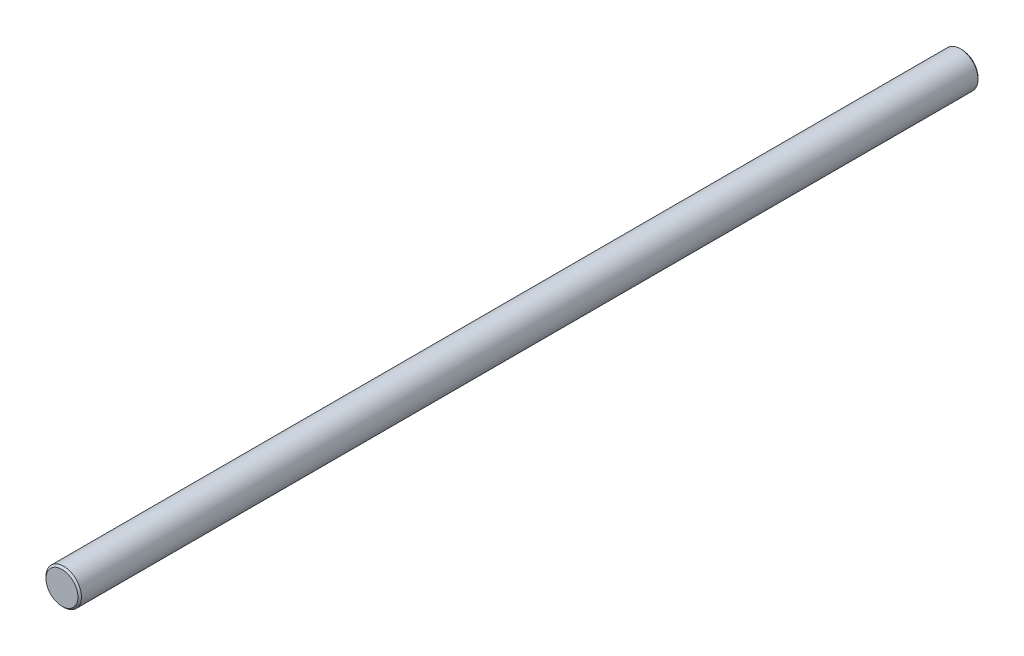
ISO-10303-21;
HEADER;
FILE_DESCRIPTION(('STEP AP214'),'2;1');
FILE_NAME('part.step','',(''),(''),'','','');
FILE_SCHEMA(('AUTOMOTIVE_DESIGN { 1 0 10303 214 1 1 1 1 }'));
ENDSEC;
DATA;
#1=APPLICATION_CONTEXT('core data for automotive mechanical design processes');
#2=APPLICATION_PROTOCOL_DEFINITION('international standard','automotive_design',2000,#1);
#3=PRODUCT_CONTEXT('',#1,'mechanical');
#4=PRODUCT('Part','Part','',(#3));
#5=PRODUCT_RELATED_PRODUCT_CATEGORY('part','',(#4));
#6=PRODUCT_DEFINITION_FORMATION('','',#4);
#7=PRODUCT_DEFINITION_CONTEXT('part definition',#1,'design');
#8=PRODUCT_DEFINITION('design','',#6,#7);
#9=PRODUCT_DEFINITION_SHAPE('','',#8);
#10=(LENGTH_UNIT() NAMED_UNIT(*) SI_UNIT(.MILLI.,.METRE.));
#11=(NAMED_UNIT(*) PLANE_ANGLE_UNIT() SI_UNIT($,.RADIAN.));
#12=(NAMED_UNIT(*) SI_UNIT($,.STERADIAN.) SOLID_ANGLE_UNIT());
#13=UNCERTAINTY_MEASURE_WITH_UNIT(LENGTH_MEASURE(1.E-05),#10,'distance_accuracy_value','');
#14=(GEOMETRIC_REPRESENTATION_CONTEXT(3) GLOBAL_UNCERTAINTY_ASSIGNED_CONTEXT((#13)) GLOBAL_UNIT_ASSIGNED_CONTEXT((#10,
#11,#12)) REPRESENTATION_CONTEXT('',''));
#15=CARTESIAN_POINT('',(0.,0.,0.));
#16=DIRECTION('',(0.,0.,1.));
#17=DIRECTION('',(1.,0.,0.));
#18=AXIS2_PLACEMENT_3D('',#15,#16,#17);
#19=CARTESIAN_POINT('',(0.,0.,507.));
#20=DIRECTION('',(0.,0.,-1.));
#21=DIRECTION('',(-1.,0.,0.));
#22=AXIS2_PLACEMENT_3D('',#19,#20,#21);
#23=CYLINDRICAL_SURFACE('',#22,10.);
#24=CARTESIAN_POINT('',(0.,0.,1.));
#25=DIRECTION('',(0.,0.,1.));
#26=DIRECTION('',(1.,0.,0.));
#27=AXIS2_PLACEMENT_3D('',#24,#25,#26);
#28=CIRCLE('',#27,10.);
#29=CARTESIAN_POINT('',(10.,0.,1.));
#30=VERTEX_POINT('',#29);
#31=EDGE_CURVE('E48',#30,#30,#28,.T.);
#32=ORIENTED_EDGE('',*,*,#31,.T.);
#33=EDGE_LOOP('',(#32));
#34=FACE_BOUND('',#33,.T.);
#35=CARTESIAN_POINT('',(0.,0.,506.));
#36=DIRECTION('',(0.,0.,1.));
#37=DIRECTION('',(1.,0.,0.));
#38=AXIS2_PLACEMENT_3D('',#35,#36,#37);
#39=CIRCLE('',#38,10.);
#40=CARTESIAN_POINT('',(10.,0.,506.));
#41=VERTEX_POINT('',#40);
#42=EDGE_CURVE('E52',#41,#41,#39,.F.);
#43=ORIENTED_EDGE('',*,*,#42,.T.);
#44=EDGE_LOOP('',(#43));
#45=FACE_BOUND('',#44,.T.);
#46=ADVANCED_FACE('F36',(#34,#45),#23,.T.);
#47=CARTESIAN_POINT('',(0.,0.,507.));
#48=DIRECTION('',(0.,0.,1.));
#49=DIRECTION('',(1.,0.,0.));
#50=AXIS2_PLACEMENT_3D('',#47,#48,#49);
#51=PLANE('',#50);
#52=CARTESIAN_POINT('',(0.,0.,507.));
#53=DIRECTION('',(0.,0.,1.));
#54=DIRECTION('',(1.,0.,0.));
#55=AXIS2_PLACEMENT_3D('',#52,#53,#54);
#56=CIRCLE('',#55,9.00000000000006);
#57=CARTESIAN_POINT('',(9.00000000000006,0.,507.));
#58=VERTEX_POINT('',#57);
#59=EDGE_CURVE('E10',#58,#58,#56,.T.);
#60=ORIENTED_EDGE('',*,*,#59,.T.);
#61=EDGE_LOOP('',(#60));
#62=FACE_BOUND('',#61,.T.);
#63=ADVANCED_FACE('F68',(#62),#51,.T.);
#64=CARTESIAN_POINT('',(0.,0.,0.));
#65=DIRECTION('',(0.,0.,1.));
#66=DIRECTION('',(1.,0.,0.));
#67=AXIS2_PLACEMENT_3D('',#64,#65,#66);
#68=PLANE('',#67);
#69=CARTESIAN_POINT('',(0.,0.,0.));
#70=DIRECTION('',(0.,0.,1.));
#71=DIRECTION('',(1.,0.,0.));
#72=AXIS2_PLACEMENT_3D('',#69,#70,#71);
#73=CIRCLE('',#72,9.00000000000001);
#74=CARTESIAN_POINT('',(9.00000000000001,0.,0.));
#75=VERTEX_POINT('',#74);
#76=EDGE_CURVE('E44',#75,#75,#73,.F.);
#77=ORIENTED_EDGE('',*,*,#76,.T.);
#78=EDGE_LOOP('',(#77));
#79=FACE_BOUND('',#78,.T.);
#80=ADVANCED_FACE('F65',(#79),#68,.F.);
#81=CARTESIAN_POINT('',(0.,0.,1.));
#82=DIRECTION('',(0.,0.,1.));
#83=DIRECTION('',(1.,0.,0.));
#84=AXIS2_PLACEMENT_3D('',#81,#82,#83);
#85=CONICAL_SURFACE('',#84,10.,0.785398163397444);
#86=ORIENTED_EDGE('',*,*,#76,.F.);
#87=EDGE_LOOP('',(#86));
#88=FACE_BOUND('',#87,.T.);
#89=ORIENTED_EDGE('',*,*,#31,.F.);
#90=EDGE_LOOP('',(#89));
#91=FACE_BOUND('',#90,.T.);
#92=ADVANCED_FACE('F61',(#88,#91),#85,.T.);
#93=CARTESIAN_POINT('',(0.,0.,507.));
#94=DIRECTION('',(0.,0.,-1.));
#95=DIRECTION('',(-1.,0.,0.));
#96=AXIS2_PLACEMENT_3D('',#93,#94,#95);
#97=CONICAL_SURFACE('',#96,9.00000000000006,0.785398163397416);
#98=ORIENTED_EDGE('',*,*,#42,.F.);
#99=EDGE_LOOP('',(#98));
#100=FACE_BOUND('',#99,.T.);
#101=ORIENTED_EDGE('',*,*,#59,.F.);
#102=EDGE_LOOP('',(#101));
#103=FACE_BOUND('',#102,.T.);
#104=ADVANCED_FACE('F39',(#100,#103),#97,.T.);
#105=CLOSED_SHELL('',(#46,#63,#80,#92,#104));
#106=MANIFOLD_SOLID_BREP('B2',#105);
#107=ADVANCED_BREP_SHAPE_REPRESENTATION('',(#18,#106),#14);
#108=SHAPE_DEFINITION_REPRESENTATION(#9,#107);
ENDSEC;
END-ISO-10303-21;
